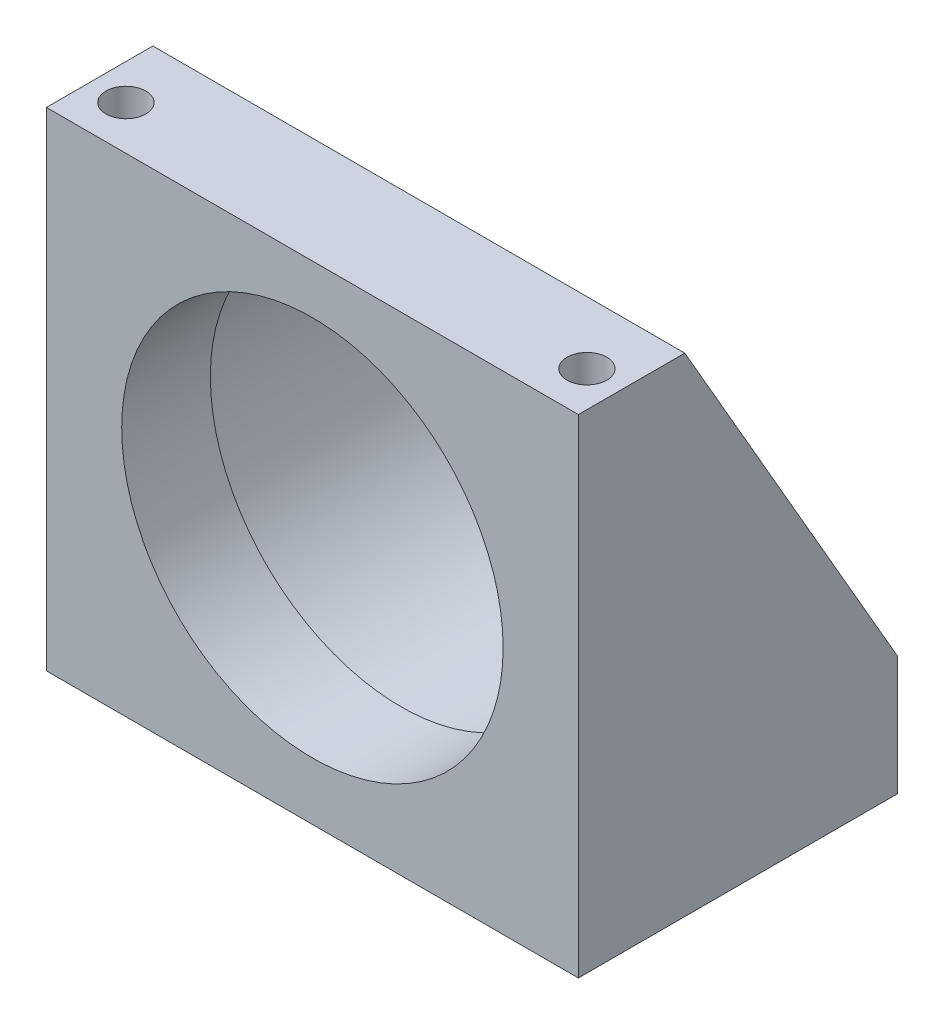
ISO-10303-21;
HEADER;
FILE_DESCRIPTION(('STEP AP214'),'2;1');
FILE_NAME('part.step','',(''),(''),'','','');
FILE_SCHEMA(('AUTOMOTIVE_DESIGN { 1 0 10303 214 1 1 1 1 }'));
ENDSEC;
DATA;
#1=APPLICATION_CONTEXT('core data for automotive mechanical design processes');
#2=APPLICATION_PROTOCOL_DEFINITION('international standard','automotive_design',2000,#1);
#3=PRODUCT_CONTEXT('',#1,'mechanical');
#4=PRODUCT('Part','Part','',(#3));
#5=PRODUCT_RELATED_PRODUCT_CATEGORY('part','',(#4));
#6=PRODUCT_DEFINITION_FORMATION('','',#4);
#7=PRODUCT_DEFINITION_CONTEXT('part definition',#1,'design');
#8=PRODUCT_DEFINITION('design','',#6,#7);
#9=PRODUCT_DEFINITION_SHAPE('','',#8);
#10=(LENGTH_UNIT() NAMED_UNIT(*) SI_UNIT(.MILLI.,.METRE.));
#11=(NAMED_UNIT(*) PLANE_ANGLE_UNIT() SI_UNIT($,.RADIAN.));
#12=(NAMED_UNIT(*) SI_UNIT($,.STERADIAN.) SOLID_ANGLE_UNIT());
#13=UNCERTAINTY_MEASURE_WITH_UNIT(LENGTH_MEASURE(1.E-05),#10,'distance_accuracy_value','');
#14=(GEOMETRIC_REPRESENTATION_CONTEXT(3) GLOBAL_UNCERTAINTY_ASSIGNED_CONTEXT((#13)) GLOBAL_UNIT_ASSIGNED_CONTEXT((#10,
#11,#12)) REPRESENTATION_CONTEXT('',''));
#15=CARTESIAN_POINT('',(0.,0.,0.));
#16=DIRECTION('',(0.,0.,1.));
#17=DIRECTION('',(1.,0.,0.));
#18=AXIS2_PLACEMENT_3D('',#15,#16,#17);
#19=CARTESIAN_POINT('',(-47.625,87.376,-57.15));
#20=DIRECTION('',(-1.,0.,0.));
#21=DIRECTION('',(0.,0.,1.));
#22=AXIS2_PLACEMENT_3D('',#19,#20,#21);
#23=PLANE('',#22);
#24=DIRECTION('',(0.,-0.866185586048601,-0.499722453489577));
#25=VECTOR('',#24,1.);
#26=CARTESIAN_POINT('',(-47.625,87.376,-19.05));
#27=LINE('',#26,#25);
#28=CARTESIAN_POINT('',(-47.625,87.376,-19.05));
#29=VERTEX_POINT('',#28);
#30=CARTESIAN_POINT('',(-47.625,21.336,-57.15));
#31=VERTEX_POINT('',#30);
#32=EDGE_CURVE('E192',#29,#31,#27,.T.);
#33=ORIENTED_EDGE('',*,*,#32,.T.);
#34=DIRECTION('',(0.,-1.,0.));
#35=VECTOR('',#34,1.);
#36=CARTESIAN_POINT('',(-47.625,87.376,-57.15));
#37=LINE('',#36,#35);
#38=CARTESIAN_POINT('',(-47.625,0.,-57.15));
#39=VERTEX_POINT('',#38);
#40=EDGE_CURVE('E105',#31,#39,#37,.T.);
#41=ORIENTED_EDGE('',*,*,#40,.T.);
#42=DIRECTION('',(0.,0.,1.));
#43=VECTOR('',#42,1.);
#44=CARTESIAN_POINT('',(-47.625,0.,-57.15));
#45=LINE('',#44,#43);
#46=CARTESIAN_POINT('',(-47.625,0.,0.));
#47=VERTEX_POINT('',#46);
#48=EDGE_CURVE('E95',#39,#47,#45,.T.);
#49=ORIENTED_EDGE('',*,*,#48,.T.);
#50=DIRECTION('',(0.,-1.,0.));
#51=VECTOR('',#50,1.);
#52=CARTESIAN_POINT('',(-47.625,87.376,0.));
#53=LINE('',#52,#51);
#54=CARTESIAN_POINT('',(-47.625,87.376,0.));
#55=VERTEX_POINT('',#54);
#56=EDGE_CURVE('E93',#55,#47,#53,.T.);
#57=ORIENTED_EDGE('',*,*,#56,.F.);
#58=DIRECTION('',(0.,0.,1.));
#59=VECTOR('',#58,1.);
#60=CARTESIAN_POINT('',(-47.625,87.376,-57.15));
#61=LINE('',#60,#59);
#62=EDGE_CURVE('E78',#29,#55,#61,.T.);
#63=ORIENTED_EDGE('',*,*,#62,.F.);
#64=EDGE_LOOP('',(#33,#41,#49,#57,#63));
#65=FACE_BOUND('',#64,.T.);
#66=ADVANCED_FACE('F35',(#65),#23,.T.);
#67=CARTESIAN_POINT('',(-47.625,87.376,-57.15));
#68=DIRECTION('',(0.,1.,0.));
#69=DIRECTION('',(0.,0.,1.));
#70=AXIS2_PLACEMENT_3D('',#67,#68,#69);
#71=PLANE('',#70);
#72=CARTESIAN_POINT('',(-41.275,87.376,-7.874));
#73=DIRECTION('',(0.,1.,0.));
#74=DIRECTION('',(0.,0.,1.));
#75=AXIS2_PLACEMENT_3D('',#72,#73,#74);
#76=CIRCLE('',#75,3.56870000000001);
#77=CARTESIAN_POINT('',(-41.275,87.376,-4.30529999999998));
#78=VERTEX_POINT('',#77);
#79=EDGE_CURVE('E178',#78,#78,#76,.T.);
#80=ORIENTED_EDGE('',*,*,#79,.F.);
#81=EDGE_LOOP('',(#80));
#82=FACE_BOUND('',#81,.T.);
#83=CARTESIAN_POINT('',(41.275,87.376,-7.874));
#84=DIRECTION('',(0.,1.,0.));
#85=DIRECTION('',(0.,0.,1.));
#86=AXIS2_PLACEMENT_3D('',#83,#84,#85);
#87=CIRCLE('',#86,3.56870000000001);
#88=CARTESIAN_POINT('',(41.275,87.376,-4.30529999999998));
#89=VERTEX_POINT('',#88);
#90=EDGE_CURVE('E182',#89,#89,#87,.T.);
#91=ORIENTED_EDGE('',*,*,#90,.F.);
#92=EDGE_LOOP('',(#91));
#93=FACE_BOUND('',#92,.T.);
#94=DIRECTION('',(1.,0.,0.));
#95=VECTOR('',#94,1.);
#96=CARTESIAN_POINT('',(-47.625,87.376,-19.05));
#97=LINE('',#96,#95);
#98=CARTESIAN_POINT('',(47.625,87.376,-19.05));
#99=VERTEX_POINT('',#98);
#100=EDGE_CURVE('E86',#29,#99,#97,.T.);
#101=ORIENTED_EDGE('',*,*,#100,.F.);
#102=ORIENTED_EDGE('',*,*,#62,.T.);
#103=DIRECTION('',(-1.,0.,0.));
#104=VECTOR('',#103,1.);
#105=CARTESIAN_POINT('',(-47.625,87.376,0.));
#106=LINE('',#105,#104);
#107=CARTESIAN_POINT('',(47.625,87.376,0.));
#108=VERTEX_POINT('',#107);
#109=EDGE_CURVE('E83',#108,#55,#106,.T.);
#110=ORIENTED_EDGE('',*,*,#109,.F.);
#111=DIRECTION('',(0.,0.,1.));
#112=VECTOR('',#111,1.);
#113=CARTESIAN_POINT('',(47.625,87.376,-57.15));
#114=LINE('',#113,#112);
#115=EDGE_CURVE('E90',#99,#108,#114,.T.);
#116=ORIENTED_EDGE('',*,*,#115,.F.);
#117=EDGE_LOOP('',(#101,#102,#110,#116));
#118=FACE_BOUND('',#117,.T.);
#119=ADVANCED_FACE('F80',(#82,#93,#118),#71,.T.);
#120=CARTESIAN_POINT('',(47.625,87.376,-57.15));
#121=DIRECTION('',(1.,0.,0.));
#122=DIRECTION('',(0.,0.,-1.));
#123=AXIS2_PLACEMENT_3D('',#120,#121,#122);
#124=PLANE('',#123);
#125=DIRECTION('',(0.,-0.866185586048601,-0.499722453489577));
#126=VECTOR('',#125,1.);
#127=CARTESIAN_POINT('',(47.625,87.376,-19.05));
#128=LINE('',#127,#126);
#129=CARTESIAN_POINT('',(47.625,21.336,-57.15));
#130=VERTEX_POINT('',#129);
#131=EDGE_CURVE('E119',#99,#130,#128,.T.);
#132=ORIENTED_EDGE('',*,*,#131,.F.);
#133=ORIENTED_EDGE('',*,*,#115,.T.);
#134=DIRECTION('',(0.,1.,0.));
#135=VECTOR('',#134,1.);
#136=CARTESIAN_POINT('',(47.625,87.376,0.));
#137=LINE('',#136,#135);
#138=CARTESIAN_POINT('',(47.625,0.,0.));
#139=VERTEX_POINT('',#138);
#140=EDGE_CURVE('E104',#139,#108,#137,.T.);
#141=ORIENTED_EDGE('',*,*,#140,.F.);
#142=DIRECTION('',(0.,0.,1.));
#143=VECTOR('',#142,1.);
#144=CARTESIAN_POINT('',(47.625,0.,-57.15));
#145=LINE('',#144,#143);
#146=CARTESIAN_POINT('',(47.625,0.,-57.15));
#147=VERTEX_POINT('',#146);
#148=EDGE_CURVE('E58',#147,#139,#145,.T.);
#149=ORIENTED_EDGE('',*,*,#148,.F.);
#150=DIRECTION('',(0.,1.,0.));
#151=VECTOR('',#150,1.);
#152=CARTESIAN_POINT('',(47.625,87.376,-57.15));
#153=LINE('',#152,#151);
#154=EDGE_CURVE('E115',#147,#130,#153,.T.);
#155=ORIENTED_EDGE('',*,*,#154,.T.);
#156=EDGE_LOOP('',(#132,#133,#141,#149,#155));
#157=FACE_BOUND('',#156,.T.);
#158=ADVANCED_FACE('F144',(#157),#124,.T.);
#159=CARTESIAN_POINT('',(-47.625,0.,-57.15));
#160=DIRECTION('',(0.,-1.,0.));
#161=DIRECTION('',(0.,0.,-1.));
#162=AXIS2_PLACEMENT_3D('',#159,#160,#161);
#163=PLANE('',#162);
#164=CARTESIAN_POINT('',(-41.275,0.,-7.874));
#165=DIRECTION('',(0.,-1.,0.));
#166=DIRECTION('',(0.,0.,-1.));
#167=AXIS2_PLACEMENT_3D('',#164,#165,#166);
#168=CIRCLE('',#167,3.56870000000001);
#169=CARTESIAN_POINT('',(-41.275,0.,-11.4427));
#170=VERTEX_POINT('',#169);
#171=EDGE_CURVE('E181',#170,#170,#168,.T.);
#172=ORIENTED_EDGE('',*,*,#171,.F.);
#173=EDGE_LOOP('',(#172));
#174=FACE_BOUND('',#173,.T.);
#175=CARTESIAN_POINT('',(41.275,0.,-7.874));
#176=DIRECTION('',(0.,-1.,0.));
#177=DIRECTION('',(0.,0.,-1.));
#178=AXIS2_PLACEMENT_3D('',#175,#176,#177);
#179=CIRCLE('',#178,3.56870000000001);
#180=CARTESIAN_POINT('',(41.275,0.,-11.4427));
#181=VERTEX_POINT('',#180);
#182=EDGE_CURVE('E185',#181,#181,#179,.T.);
#183=ORIENTED_EDGE('',*,*,#182,.F.);
#184=EDGE_LOOP('',(#183));
#185=FACE_BOUND('',#184,.T.);
#186=DIRECTION('',(1.,0.,0.));
#187=VECTOR('',#186,1.);
#188=CARTESIAN_POINT('',(-47.625,0.,0.));
#189=LINE('',#188,#187);
#190=EDGE_CURVE('E99',#47,#139,#189,.T.);
#191=ORIENTED_EDGE('',*,*,#190,.F.);
#192=ORIENTED_EDGE('',*,*,#48,.F.);
#193=DIRECTION('',(1.,0.,0.));
#194=VECTOR('',#193,1.);
#195=CARTESIAN_POINT('',(-47.625,0.,-57.15));
#196=LINE('',#195,#194);
#197=EDGE_CURVE('E107',#39,#147,#196,.T.);
#198=ORIENTED_EDGE('',*,*,#197,.T.);
#199=ORIENTED_EDGE('',*,*,#148,.T.);
#200=EDGE_LOOP('',(#191,#192,#198,#199));
#201=FACE_BOUND('',#200,.T.);
#202=ADVANCED_FACE('F148',(#174,#185,#201),#163,.T.);
#203=CARTESIAN_POINT('',(-47.625,0.,-57.15));
#204=DIRECTION('',(0.,0.,1.));
#205=DIRECTION('',(1.,0.,0.));
#206=AXIS2_PLACEMENT_3D('',#203,#204,#205);
#207=PLANE('',#206);
#208=DIRECTION('',(1.,0.,0.));
#209=VECTOR('',#208,1.);
#210=CARTESIAN_POINT('',(-47.625,21.336,-57.15));
#211=LINE('',#210,#209);
#212=CARTESIAN_POINT('',(-28.3469007124236,21.336,-57.15));
#213=VERTEX_POINT('',#212);
#214=EDGE_CURVE('E196',#31,#213,#211,.T.);
#215=ORIENTED_EDGE('',*,*,#214,.T.);
#216=CARTESIAN_POINT('',(0.,44.45,-57.15));
#217=DIRECTION('',(0.,0.,-1.));
#218=DIRECTION('',(-1.,0.,0.));
#219=AXIS2_PLACEMENT_3D('',#216,#217,#218);
#220=CIRCLE('',#219,36.576);
#221=CARTESIAN_POINT('',(28.3469007124236,21.336,-57.15));
#222=VERTEX_POINT('',#221);
#223=EDGE_CURVE('E49',#222,#213,#220,.T.);
#224=ORIENTED_EDGE('',*,*,#223,.F.);
#225=EDGE_CURVE('E199',#222,#130,#211,.T.);
#226=ORIENTED_EDGE('',*,*,#225,.T.);
#227=ORIENTED_EDGE('',*,*,#154,.F.);
#228=ORIENTED_EDGE('',*,*,#197,.F.);
#229=ORIENTED_EDGE('',*,*,#40,.F.);
#230=EDGE_LOOP('',(#215,#224,#226,#227,#228,#229));
#231=FACE_BOUND('',#230,.T.);
#232=ADVANCED_FACE('F151',(#231),#207,.F.);
#233=CARTESIAN_POINT('',(-47.625,0.,0.));
#234=DIRECTION('',(0.,0.,1.));
#235=DIRECTION('',(1.,0.,0.));
#236=AXIS2_PLACEMENT_3D('',#233,#234,#235);
#237=PLANE('',#236);
#238=CARTESIAN_POINT('',(0.,44.45,0.));
#239=DIRECTION('',(0.,0.,1.));
#240=DIRECTION('',(1.,0.,0.));
#241=AXIS2_PLACEMENT_3D('',#238,#239,#240);
#242=CIRCLE('',#241,34.1503);
#243=CARTESIAN_POINT('',(34.1503,44.45,0.));
#244=VERTEX_POINT('',#243);
#245=EDGE_CURVE('E100',#244,#244,#242,.T.);
#246=ORIENTED_EDGE('',*,*,#245,.F.);
#247=EDGE_LOOP('',(#246));
#248=FACE_BOUND('',#247,.T.);
#249=ORIENTED_EDGE('',*,*,#56,.T.);
#250=ORIENTED_EDGE('',*,*,#190,.T.);
#251=ORIENTED_EDGE('',*,*,#140,.T.);
#252=ORIENTED_EDGE('',*,*,#109,.T.);
#253=EDGE_LOOP('',(#249,#250,#251,#252));
#254=FACE_BOUND('',#253,.T.);
#255=ADVANCED_FACE('F103',(#248,#254),#237,.T.);
#256=CARTESIAN_POINT('',(0.,44.45,-57.15));
#257=DIRECTION('',(0.,0.,1.));
#258=DIRECTION('',(1.,0.,0.));
#259=AXIS2_PLACEMENT_3D('',#256,#257,#258);
#260=CYLINDRICAL_SURFACE('',#259,34.1503);
#261=CARTESIAN_POINT('',(0.,44.45,-15.875));
#262=DIRECTION('',(0.,0.,1.));
#263=DIRECTION('',(1.,0.,0.));
#264=AXIS2_PLACEMENT_3D('',#261,#262,#263);
#265=CIRCLE('',#264,34.1503);
#266=CARTESIAN_POINT('',(34.1503,44.45,-15.875));
#267=VERTEX_POINT('',#266);
#268=EDGE_CURVE('E117',#267,#267,#265,.F.);
#269=ORIENTED_EDGE('',*,*,#268,.T.);
#270=EDGE_LOOP('',(#269));
#271=FACE_BOUND('',#270,.T.);
#272=ORIENTED_EDGE('',*,*,#245,.T.);
#273=EDGE_LOOP('',(#272));
#274=FACE_BOUND('',#273,.T.);
#275=ADVANCED_FACE('F157',(#271,#274),#260,.F.);
#276=CARTESIAN_POINT('',(-47.625,87.376,-19.05));
#277=DIRECTION('',(0.,-0.499722453489577,0.8661855860486));
#278=DIRECTION('',(0.,-0.866185586048601,-0.499722453489577));
#279=AXIS2_PLACEMENT_3D('',#276,#277,#278);
#280=PLANE('',#279);
#281=ORIENTED_EDGE('',*,*,#225,.F.);
#282=CARTESIAN_POINT('',(0.,44.45,-43.815));
#283=DIRECTION('',(0.,-0.499722453489577,0.8661855860486));
#284=DIRECTION('',(0.,-0.866185586048601,-0.499722453489577));
#285=AXIS2_PLACEMENT_3D('',#282,#283,#284);
#286=ELLIPSE('',#285,42.2265165677183,36.576);
#287=EDGE_CURVE('E89',#222,#213,#286,.T.);
#288=ORIENTED_EDGE('',*,*,#287,.T.);
#289=ORIENTED_EDGE('',*,*,#214,.F.);
#290=ORIENTED_EDGE('',*,*,#32,.F.);
#291=ORIENTED_EDGE('',*,*,#100,.T.);
#292=ORIENTED_EDGE('',*,*,#131,.T.);
#293=EDGE_LOOP('',(#281,#288,#289,#290,#291,#292));
#294=FACE_BOUND('',#293,.T.);
#295=ADVANCED_FACE('F164',(#294),#280,.F.);
#296=CARTESIAN_POINT('',(-47.625,0.,-15.875));
#297=DIRECTION('',(0.,0.,1.));
#298=DIRECTION('',(1.,0.,0.));
#299=AXIS2_PLACEMENT_3D('',#296,#297,#298);
#300=PLANE('',#299);
#301=CARTESIAN_POINT('',(0.,44.45,-15.875));
#302=DIRECTION('',(0.,0.,1.));
#303=DIRECTION('',(1.,0.,0.));
#304=AXIS2_PLACEMENT_3D('',#301,#302,#303);
#305=CIRCLE('',#304,35.052);
#306=CARTESIAN_POINT('',(35.052,44.45,-15.875));
#307=VERTEX_POINT('',#306);
#308=EDGE_CURVE('E43',#307,#307,#305,.F.);
#309=ORIENTED_EDGE('',*,*,#308,.T.);
#310=EDGE_LOOP('',(#309));
#311=FACE_BOUND('',#310,.T.);
#312=ORIENTED_EDGE('',*,*,#268,.F.);
#313=EDGE_LOOP('',(#312));
#314=FACE_BOUND('',#313,.T.);
#315=ADVANCED_FACE('F123',(#311,#314),#300,.F.);
#316=CARTESIAN_POINT('',(0.,44.45,103.452550514717));
#317=DIRECTION('',(0.,0.,-1.));
#318=DIRECTION('',(-1.,0.,0.));
#319=AXIS2_PLACEMENT_3D('',#316,#317,#318);
#320=CYLINDRICAL_SURFACE('',#319,36.576);
#321=CARTESIAN_POINT('',(0.,44.45,-17.399));
#322=DIRECTION('',(0.,0.,1.));
#323=DIRECTION('',(1.,0.,0.));
#324=AXIS2_PLACEMENT_3D('',#321,#322,#323);
#325=CIRCLE('',#324,36.576);
#326=CARTESIAN_POINT('',(36.576,44.45,-17.399));
#327=VERTEX_POINT('',#326);
#328=EDGE_CURVE('E12',#327,#327,#325,.T.);
#329=ORIENTED_EDGE('',*,*,#328,.T.);
#330=EDGE_LOOP('',(#329));
#331=FACE_BOUND('',#330,.T.);
#332=ORIENTED_EDGE('',*,*,#223,.T.);
#333=ORIENTED_EDGE('',*,*,#287,.F.);
#334=EDGE_LOOP('',(#332,#333));
#335=FACE_BOUND('',#334,.T.);
#336=ADVANCED_FACE('F128',(#331,#335),#320,.F.);
#337=CARTESIAN_POINT('',(0.,44.45,-17.399));
#338=DIRECTION('',(0.,0.,1.));
#339=DIRECTION('',(1.,0.,0.));
#340=AXIS2_PLACEMENT_3D('',#337,#338,#339);
#341=TOROIDAL_SURFACE('',#340,35.052,1.524);
#342=ORIENTED_EDGE('',*,*,#328,.F.);
#343=EDGE_LOOP('',(#342));
#344=FACE_BOUND('',#343,.T.);
#345=ORIENTED_EDGE('',*,*,#308,.F.);
#346=EDGE_LOOP('',(#345));
#347=FACE_BOUND('',#346,.T.);
#348=ADVANCED_FACE('F37',(#344,#347),#341,.F.);
#349=CARTESIAN_POINT('',(41.275,87.376,-7.874));
#350=DIRECTION('',(0.,1.,0.));
#351=DIRECTION('',(0.,0.,1.));
#352=AXIS2_PLACEMENT_3D('',#349,#350,#351);
#353=CYLINDRICAL_SURFACE('',#352,3.56870000000001);
#354=ORIENTED_EDGE('',*,*,#90,.T.);
#355=EDGE_LOOP('',(#354));
#356=FACE_BOUND('',#355,.T.);
#357=ORIENTED_EDGE('',*,*,#182,.T.);
#358=EDGE_LOOP('',(#357));
#359=FACE_BOUND('',#358,.T.);
#360=ADVANCED_FACE('F127',(#356,#359),#353,.F.);
#361=CARTESIAN_POINT('',(-41.275,87.376,-7.874));
#362=DIRECTION('',(0.,1.,0.));
#363=DIRECTION('',(0.,0.,1.));
#364=AXIS2_PLACEMENT_3D('',#361,#362,#363);
#365=CYLINDRICAL_SURFACE('',#364,3.56870000000001);
#366=ORIENTED_EDGE('',*,*,#79,.T.);
#367=EDGE_LOOP('',(#366));
#368=FACE_BOUND('',#367,.T.);
#369=ORIENTED_EDGE('',*,*,#171,.T.);
#370=EDGE_LOOP('',(#369));
#371=FACE_BOUND('',#370,.T.);
#372=ADVANCED_FACE('F134',(#368,#371),#365,.F.);
#373=CLOSED_SHELL('',(#66,#119,#158,#202,#232,#255,#275,#295,#315,#336,#348,#360,#372));
#374=MANIFOLD_SOLID_BREP('B2',#373);
#375=ADVANCED_BREP_SHAPE_REPRESENTATION('',(#18,#374),#14);
#376=SHAPE_DEFINITION_REPRESENTATION(#9,#375);
ENDSEC;
END-ISO-10303-21;
